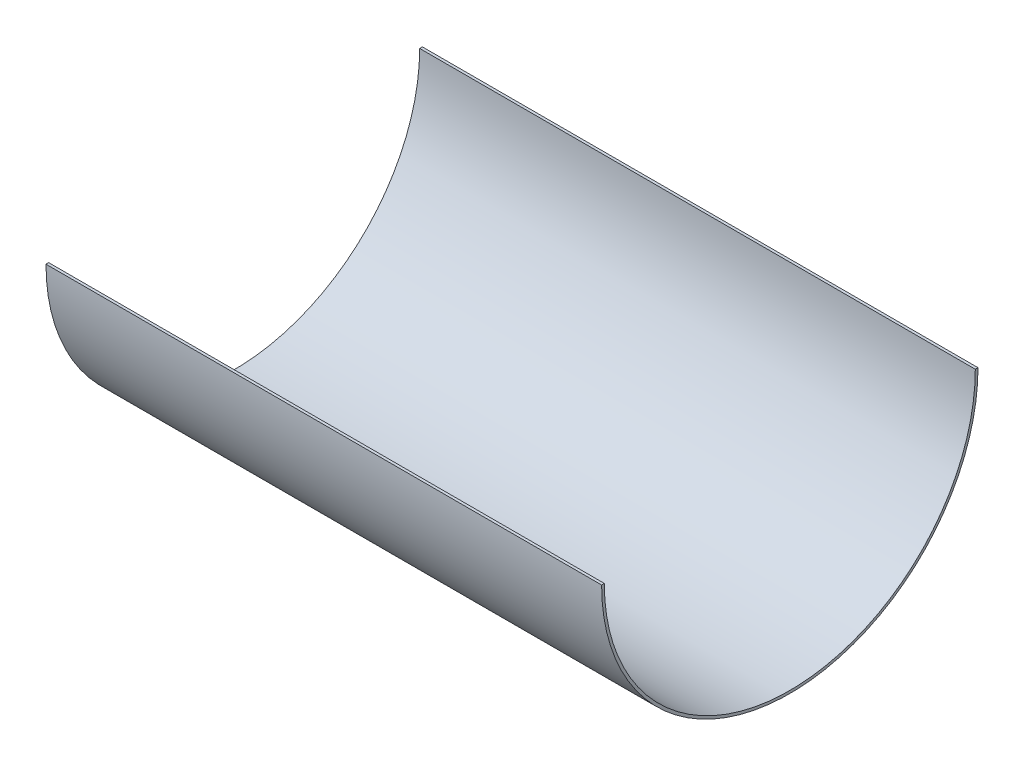
ISO-10303-21;
HEADER;
FILE_DESCRIPTION(('STEP AP214'),'2;1');
FILE_NAME('part.step','',(''),(''),'','','');
FILE_SCHEMA(('AUTOMOTIVE_DESIGN { 1 0 10303 214 1 1 1 1 }'));
ENDSEC;
DATA;
#1=APPLICATION_CONTEXT('core data for automotive mechanical design processes');
#2=APPLICATION_PROTOCOL_DEFINITION('international standard','automotive_design',2000,#1);
#3=PRODUCT_CONTEXT('',#1,'mechanical');
#4=PRODUCT('Part','Part','',(#3));
#5=PRODUCT_RELATED_PRODUCT_CATEGORY('part','',(#4));
#6=PRODUCT_DEFINITION_FORMATION('','',#4);
#7=PRODUCT_DEFINITION_CONTEXT('part definition',#1,'design');
#8=PRODUCT_DEFINITION('design','',#6,#7);
#9=PRODUCT_DEFINITION_SHAPE('','',#8);
#10=(LENGTH_UNIT() NAMED_UNIT(*) SI_UNIT(.MILLI.,.METRE.));
#11=(NAMED_UNIT(*) PLANE_ANGLE_UNIT() SI_UNIT($,.RADIAN.));
#12=(NAMED_UNIT(*) SI_UNIT($,.STERADIAN.) SOLID_ANGLE_UNIT());
#13=UNCERTAINTY_MEASURE_WITH_UNIT(LENGTH_MEASURE(1.E-05),#10,'distance_accuracy_value','');
#14=(GEOMETRIC_REPRESENTATION_CONTEXT(3) GLOBAL_UNCERTAINTY_ASSIGNED_CONTEXT((#13)) GLOBAL_UNIT_ASSIGNED_CONTEXT((#10,
#11,#12)) REPRESENTATION_CONTEXT('',''));
#15=CARTESIAN_POINT('',(0.,0.,0.));
#16=DIRECTION('',(0.,0.,1.));
#17=DIRECTION('',(1.,0.,0.));
#18=AXIS2_PLACEMENT_3D('',#15,#16,#17);
#19=CARTESIAN_POINT('',(-396.592099755992,0.,312.435963201851));
#20=DIRECTION('',(-1.,0.,0.));
#21=DIRECTION('',(0.,0.,1.));
#22=AXIS2_PLACEMENT_3D('',#19,#20,#21);
#23=CYLINDRICAL_SURFACE('',#22,210.);
#24=DIRECTION('',(-1.,0.,0.));
#25=VECTOR('',#24,1.);
#26=CARTESIAN_POINT('',(-396.592099755992,0.,102.435963201851));
#27=LINE('',#26,#25);
#28=CARTESIAN_POINT('',(581.58387703481,0.,102.435963201851));
#29=VERTEX_POINT('',#28);
#30=CARTESIAN_POINT('',(-38.4161229651902,0.,102.435963201851));
#31=VERTEX_POINT('',#30);
#32=EDGE_CURVE('E99',#29,#31,#27,.T.);
#33=ORIENTED_EDGE('',*,*,#32,.F.);
#34=CARTESIAN_POINT('',(581.58387703481,0.,312.435963201851));
#35=DIRECTION('',(-1.,0.,0.));
#36=DIRECTION('',(0.,0.,1.));
#37=AXIS2_PLACEMENT_3D('',#34,#35,#36);
#38=CIRCLE('',#37,210.);
#39=CARTESIAN_POINT('',(581.58387703481,0.,522.435963201851));
#40=VERTEX_POINT('',#39);
#41=EDGE_CURVE('E42',#29,#40,#38,.T.);
#42=ORIENTED_EDGE('',*,*,#41,.T.);
#43=DIRECTION('',(-1.,0.,0.));
#44=VECTOR('',#43,1.);
#45=CARTESIAN_POINT('',(-396.592099755992,0.,522.435963201851));
#46=LINE('',#45,#44);
#47=CARTESIAN_POINT('',(-38.4161229651903,0.,522.435963201851));
#48=VERTEX_POINT('',#47);
#49=EDGE_CURVE('E94',#48,#40,#46,.F.);
#50=ORIENTED_EDGE('',*,*,#49,.F.);
#51=CARTESIAN_POINT('',(-38.4161229651903,0.,312.435963201851));
#52=DIRECTION('',(-1.,0.,0.));
#53=DIRECTION('',(0.,0.,1.));
#54=AXIS2_PLACEMENT_3D('',#51,#52,#53);
#55=CIRCLE('',#54,210.);
#56=EDGE_CURVE('E11',#31,#48,#55,.T.);
#57=ORIENTED_EDGE('',*,*,#56,.F.);
#58=EDGE_LOOP('',(#33,#42,#50,#57));
#59=FACE_BOUND('',#58,.T.);
#60=ADVANCED_FACE('F35',(#59),#23,.T.);
#61=CARTESIAN_POINT('',(581.572240946435,0.,105.435963201855));
#62=CARTESIAN_POINT('',(582.424150652376,0.,105.442600659164));
#63=CARTESIAN_POINT('',(584.137918536488,0.,105.468851394561));
#64=CARTESIAN_POINT('',(587.484086921425,0.,105.571526795944));
#65=CARTESIAN_POINT('',(591.571096113027,0.,105.792916991487));
#66=CARTESIAN_POINT('',(596.307608868529,0.,106.202626940194));
#67=CARTESIAN_POINT('',(602.409126826052,0.,106.934758125947));
#68=CARTESIAN_POINT('',(609.639419086535,0.,108.18665602962));
#69=CARTESIAN_POINT('',(617.70585707123,0.,110.190510235831));
#70=CARTESIAN_POINT('',(625.186745255784,0.,112.659295821792));
#71=CARTESIAN_POINT('',(634.414245375346,0.,116.523312816482));
#72=CARTESIAN_POINT('',(644.61207372756,0.,122.339029978004));
#73=CARTESIAN_POINT('',(654.913796391652,0.,130.630357057189));
#74=CARTESIAN_POINT('',(663.46928585493,0.,139.982021209339));
#75=CARTESIAN_POINT('',(670.45039121658,0.,150.141502012286));
#76=CARTESIAN_POINT('',(676.016737994154,0.,160.847618744532));
#77=CARTESIAN_POINT('',(680.323342135693,0.,171.82903786729));
#78=CARTESIAN_POINT('',(683.525745860682,0.,182.806951111899));
#79=CARTESIAN_POINT('',(685.782094183419,0.,193.498408860527));
#80=CARTESIAN_POINT('',(687.253383878059,0.,203.618874423817));
#81=CARTESIAN_POINT('',(687.961369137142,0.,211.33978533163));
#82=CARTESIAN_POINT('',(688.299442483134,0.,216.947462036163));
#83=CARTESIAN_POINT('',(688.459593049096,0.,220.834002423392));
#84=CARTESIAN_POINT('',(688.547117141363,0.,224.365875374698));
#85=CARTESIAN_POINT('',(688.582824388612,0.,227.512914090602));
#86=CARTESIAN_POINT('',(688.586742369723,0.,229.777140480908));
#87=CARTESIAN_POINT('',(688.584795316882,0.,231.383827188645));
#88=CARTESIAN_POINT('',(688.583877034809,0.,232.075985648928));
#89=CARTESIAN_POINT('',(688.583877034809,0.,232.435963191891));
#90=B_SPLINE_CURVE_WITH_KNOTS('',3,(#61,#62,#63,#64,#65,#66,#67,#68,#69,#70,#71,#72,#73,#74,#75,
#76,#77,#78,#79,#80,#81,#82,#83,#84,#85,#86,#87,#88,#89),.UNSPECIFIED.,.F.,.F.,(4,1,1,1,1,1,1,1,
1,1,1,1,1,1,1,1,1,1,1,1,1,1,1,1,1,1,4),(3.49728876252685E-05,0.0078471996619407,
0.0156594264362561,0.031283879984887,0.0469083335335178,0.0625327870821487,0.0937816941794104,
0.125030601276672,0.156279508373934,0.187528415471196,0.250026229665719,0.312524043860242,
0.375021858054766,0.437519672249289,0.500017486443813,0.562515300638336,0.625013114832859,
0.687510929027383,0.750008743221906,0.81250655741643,0.843755464513691,0.875004371610953,
0.906253278708215,0.937502185805477,0.968751092902738,0.984375546451369,1.),.UNSPECIFIED.);
#91=CARTESIAN_POINT('',(-396.592099755992,0.,312.435963201851));
#92=DIRECTION('',(-1.,0.,0.));
#93=AXIS1_PLACEMENT('',#91,#92);
#94=SURFACE_OF_REVOLUTION('',#90,#93);
#95=CARTESIAN_POINT('',(581.572240946435,0.,519.435963201847));
#96=CARTESIAN_POINT('',(582.424150652376,0.,519.429325744537));
#97=CARTESIAN_POINT('',(584.137918536488,0.,519.40307500914));
#98=CARTESIAN_POINT('',(587.484086921425,0.,519.300399607757));
#99=CARTESIAN_POINT('',(591.571096113027,0.,519.079009412215));
#100=CARTESIAN_POINT('',(596.307608868529,0.,518.669299463507));
#101=CARTESIAN_POINT('',(602.409126826052,0.,517.937168277754));
#102=CARTESIAN_POINT('',(609.639419086535,0.,516.685270374081));
#103=CARTESIAN_POINT('',(617.70585707123,0.,514.68141616787));
#104=CARTESIAN_POINT('',(625.186745255784,0.,512.212630581909));
#105=CARTESIAN_POINT('',(634.414245375346,0.,508.34861358722));
#106=CARTESIAN_POINT('',(644.61207372756,0.,502.532896425697));
#107=CARTESIAN_POINT('',(654.913796391652,0.,494.241569346513));
#108=CARTESIAN_POINT('',(663.46928585493,0.,484.889905194362));
#109=CARTESIAN_POINT('',(670.45039121658,0.,474.730424391415));
#110=CARTESIAN_POINT('',(676.016737994154,0.,464.024307659169));
#111=CARTESIAN_POINT('',(680.323342135693,0.,453.042888536411));
#112=CARTESIAN_POINT('',(683.525745860682,0.,442.064975291802));
#113=CARTESIAN_POINT('',(685.782094183419,0.,431.373517543175));
#114=CARTESIAN_POINT('',(687.253383878059,0.,421.253051979885));
#115=CARTESIAN_POINT('',(687.961369137142,0.,413.532141072071));
#116=CARTESIAN_POINT('',(688.299442483134,0.,407.924464367538));
#117=CARTESIAN_POINT('',(688.459593049096,0.,404.03792398031));
#118=CARTESIAN_POINT('',(688.547117141363,0.,400.506051029004));
#119=CARTESIAN_POINT('',(688.582824388612,0.,397.359012313099));
#120=CARTESIAN_POINT('',(688.586742369723,0.,395.094785922793));
#121=CARTESIAN_POINT('',(688.584795316882,0.,393.488099215056));
#122=CARTESIAN_POINT('',(688.583877034809,0.,392.795940754773));
#123=CARTESIAN_POINT('',(688.583877034809,0.,392.43596321181));
#124=B_SPLINE_CURVE_WITH_KNOTS('',3,(#95,#96,#97,#98,#99,#100,#101,#102,#103,#104,#105,#106,
#107,#108,#109,#110,#111,#112,#113,#114,#115,#116,#117,#118,#119,#120,#121,#122,#123),
.UNSPECIFIED.,.F.,.F.,(4,1,1,1,1,1,1,1,1,1,1,1,1,1,1,1,1,1,1,1,1,1,1,1,1,1,4),
(3.49728876252685E-05,0.0078471996619407,0.0156594264362561,0.031283879984887,
0.0469083335335178,0.0625327870821487,0.0937816941794104,0.125030601276672,0.156279508373934,
0.187528415471196,0.250026229665719,0.312524043860242,0.375021858054766,0.437519672249289,
0.500017486443813,0.562515300638336,0.625013114832859,0.687510929027383,0.750008743221906,
0.81250655741643,0.843755464513691,0.875004371610953,0.906253278708215,0.937502185805477,
0.968751092902738,0.984375546451369,1.),.UNSPECIFIED.);
#125=CARTESIAN_POINT('',(581.58387703481,0.,519.435872140929));
#126=VERTEX_POINT('',#125);
#127=CARTESIAN_POINT('',(581.572240946435,0.,519.435959901095));
#128=VERTEX_POINT('',#127);
#129=EDGE_CURVE('E57',#126,#128,#124,.F.);
#130=ORIENTED_EDGE('',*,*,#129,.F.);
#131=CARTESIAN_POINT('',(581.58387703481,0.,312.435963201851));
#132=DIRECTION('',(-1.,0.,0.));
#133=DIRECTION('',(0.,0.,1.));
#134=AXIS2_PLACEMENT_3D('',#131,#132,#133);
#135=CIRCLE('',#134,206.999908939078);
#136=CARTESIAN_POINT('',(581.58387703481,0.,105.436054262773));
#137=VERTEX_POINT('',#136);
#138=EDGE_CURVE('E88',#126,#137,#135,.F.);
#139=ORIENTED_EDGE('',*,*,#138,.T.);
#140=CARTESIAN_POINT('',(581.572240946435,0.,105.435963201855));
#141=CARTESIAN_POINT('',(582.424150652376,0.,105.442600659164));
#142=CARTESIAN_POINT('',(584.137918536488,0.,105.468851394561));
#143=CARTESIAN_POINT('',(587.484086921425,0.,105.571526795944));
#144=CARTESIAN_POINT('',(591.571096113027,0.,105.792916991487));
#145=CARTESIAN_POINT('',(596.307608868529,0.,106.202626940194));
#146=CARTESIAN_POINT('',(602.409126826052,0.,106.934758125947));
#147=CARTESIAN_POINT('',(609.639419086535,0.,108.18665602962));
#148=CARTESIAN_POINT('',(617.70585707123,0.,110.190510235831));
#149=CARTESIAN_POINT('',(625.186745255784,0.,112.659295821792));
#150=CARTESIAN_POINT('',(634.414245375346,0.,116.523312816482));
#151=CARTESIAN_POINT('',(644.61207372756,0.,122.339029978004));
#152=CARTESIAN_POINT('',(654.913796391652,0.,130.630357057189));
#153=CARTESIAN_POINT('',(663.46928585493,0.,139.982021209339));
#154=CARTESIAN_POINT('',(670.45039121658,0.,150.141502012286));
#155=CARTESIAN_POINT('',(676.016737994154,0.,160.847618744532));
#156=CARTESIAN_POINT('',(680.323342135693,0.,171.82903786729));
#157=CARTESIAN_POINT('',(683.525745860682,0.,182.806951111899));
#158=CARTESIAN_POINT('',(685.782094183419,0.,193.498408860527));
#159=CARTESIAN_POINT('',(687.253383878059,0.,203.618874423817));
#160=CARTESIAN_POINT('',(687.961369137142,0.,211.33978533163));
#161=CARTESIAN_POINT('',(688.299442483134,0.,216.947462036163));
#162=CARTESIAN_POINT('',(688.459593049096,0.,220.834002423392));
#163=CARTESIAN_POINT('',(688.547117141363,0.,224.365875374698));
#164=CARTESIAN_POINT('',(688.582824388612,0.,227.512914090602));
#165=CARTESIAN_POINT('',(688.586742369723,0.,229.777140480908));
#166=CARTESIAN_POINT('',(688.584795316882,0.,231.383827188645));
#167=CARTESIAN_POINT('',(688.583877034809,0.,232.075985648928));
#168=CARTESIAN_POINT('',(688.583877034809,0.,232.435963191891));
#169=B_SPLINE_CURVE_WITH_KNOTS('',3,(#140,#141,#142,#143,#144,#145,#146,#147,#148,#149,#150,
#151,#152,#153,#154,#155,#156,#157,#158,#159,#160,#161,#162,#163,#164,#165,#166,#167,#168),
.UNSPECIFIED.,.F.,.F.,(4,1,1,1,1,1,1,1,1,1,1,1,1,1,1,1,1,1,1,1,1,1,1,1,1,1,4),
(3.49728876252685E-05,0.0078471996619407,0.0156594264362561,0.031283879984887,
0.0469083335335178,0.0625327870821487,0.0937816941794104,0.125030601276672,0.156279508373934,
0.187528415471196,0.250026229665719,0.312524043860242,0.375021858054766,0.437519672249289,
0.500017486443813,0.562515300638336,0.625013114832859,0.687510929027383,0.750008743221906,
0.81250655741643,0.843755464513691,0.875004371610953,0.906253278708215,0.937502185805477,
0.968751092902738,0.984375546451369,1.),.UNSPECIFIED.);
#170=CARTESIAN_POINT('',(581.572240946435,0.,105.435966502606));
#171=VERTEX_POINT('',#170);
#172=EDGE_CURVE('E100',#171,#137,#169,.T.);
#173=ORIENTED_EDGE('',*,*,#172,.F.);
#174=CARTESIAN_POINT('',(581.572240946435,0.,312.435963201851));
#175=DIRECTION('',(-1.,0.,0.));
#176=DIRECTION('',(0.,0.,1.));
#177=AXIS2_PLACEMENT_3D('',#174,#175,#176);
#178=CIRCLE('',#177,206.999999999996);
#179=EDGE_CURVE('E104',#171,#128,#178,.T.);
#180=ORIENTED_EDGE('',*,*,#179,.T.);
#181=EDGE_LOOP('',(#130,#139,#173,#180));
#182=FACE_BOUND('',#181,.T.);
#183=ADVANCED_FACE('F118',(#182),#94,.T.);
#184=CARTESIAN_POINT('',(-396.592099755992,0.,312.435963201851));
#185=DIRECTION('',(-1.,0.,0.));
#186=DIRECTION('',(0.,0.,1.));
#187=AXIS2_PLACEMENT_3D('',#184,#185,#186);
#188=CYLINDRICAL_SURFACE('',#187,206.999996699244);
#189=DIRECTION('',(-1.,0.,0.));
#190=VECTOR('',#189,1.);
#191=CARTESIAN_POINT('',(-396.592099755992,0.,105.435966502606));
#192=LINE('',#191,#190);
#193=CARTESIAN_POINT('',(-38.416122951138,0.,105.435969803358));
#194=VERTEX_POINT('',#193);
#195=EDGE_CURVE('E49',#194,#171,#192,.F.);
#196=ORIENTED_EDGE('',*,*,#195,.F.);
#197=CARTESIAN_POINT('',(-38.416122951138,0.,312.435963201851));
#198=DIRECTION('',(-1.,0.,0.));
#199=DIRECTION('',(0.,0.,1.));
#200=AXIS2_PLACEMENT_3D('',#197,#198,#199);
#201=CIRCLE('',#200,206.999993398492);
#202=CARTESIAN_POINT('',(-38.4161229651903,0.,519.435958250719));
#203=VERTEX_POINT('',#202);
#204=EDGE_CURVE('E106',#194,#203,#201,.T.);
#205=ORIENTED_EDGE('',*,*,#204,.T.);
#206=DIRECTION('',(-1.,0.,0.));
#207=VECTOR('',#206,1.);
#208=CARTESIAN_POINT('',(-396.592099755992,0.,519.435959901095));
#209=LINE('',#208,#207);
#210=EDGE_CURVE('E89',#128,#203,#209,.T.);
#211=ORIENTED_EDGE('',*,*,#210,.F.);
#212=ORIENTED_EDGE('',*,*,#179,.F.);
#213=EDGE_LOOP('',(#196,#205,#211,#212));
#214=FACE_BOUND('',#213,.T.);
#215=ADVANCED_FACE('F121',(#214),#188,.F.);
#216=CARTESIAN_POINT('',(1604.84151052828,0.,737.495931307423));
#217=DIRECTION('',(0.,1.,0.));
#218=DIRECTION('',(-1.,0.,0.));
#219=AXIS2_PLACEMENT_3D('',#216,#217,#218);
#220=PLANE('',#219);
#221=ORIENTED_EDGE('',*,*,#32,.T.);
#222=DIRECTION('',(0.,0.,-1.));
#223=VECTOR('',#222,1.);
#224=CARTESIAN_POINT('',(-38.4161229651903,0.,737.495931307423));
#225=LINE('',#224,#223);
#226=EDGE_CURVE('E178',#194,#31,#225,.T.);
#227=ORIENTED_EDGE('',*,*,#226,.F.);
#228=ORIENTED_EDGE('',*,*,#195,.T.);
#229=ORIENTED_EDGE('',*,*,#172,.T.);
#230=DIRECTION('',(0.,0.,-1.));
#231=VECTOR('',#230,1.);
#232=CARTESIAN_POINT('',(581.58387703481,0.,737.495931307423));
#233=LINE('',#232,#231);
#234=EDGE_CURVE('E90',#137,#29,#233,.T.);
#235=ORIENTED_EDGE('',*,*,#234,.T.);
#236=EDGE_LOOP('',(#221,#227,#228,#229,#235));
#237=FACE_BOUND('',#236,.T.);
#238=ADVANCED_FACE('F125',(#237),#220,.T.);
#239=ORIENTED_EDGE('',*,*,#49,.T.);
#240=EDGE_CURVE('E82',#40,#126,#233,.T.);
#241=ORIENTED_EDGE('',*,*,#240,.T.);
#242=ORIENTED_EDGE('',*,*,#129,.T.);
#243=ORIENTED_EDGE('',*,*,#210,.T.);
#244=EDGE_CURVE('E96',#48,#203,#225,.T.);
#245=ORIENTED_EDGE('',*,*,#244,.F.);
#246=EDGE_LOOP('',(#239,#241,#242,#243,#245));
#247=FACE_BOUND('',#246,.T.);
#248=ADVANCED_FACE('F95',(#247),#220,.T.);
#249=CARTESIAN_POINT('',(-38.4161229651903,-500.,-104.316345756687));
#250=DIRECTION('',(1.,0.,0.));
#251=DIRECTION('',(0.,0.,-1.));
#252=AXIS2_PLACEMENT_3D('',#249,#250,#251);
#253=PLANE('',#252);
#254=ORIENTED_EDGE('',*,*,#226,.T.);
#255=ORIENTED_EDGE('',*,*,#56,.T.);
#256=ORIENTED_EDGE('',*,*,#244,.T.);
#257=ORIENTED_EDGE('',*,*,#204,.F.);
#258=EDGE_LOOP('',(#254,#255,#256,#257));
#259=FACE_BOUND('',#258,.T.);
#260=ADVANCED_FACE('F129',(#259),#253,.F.);
#261=CARTESIAN_POINT('',(581.58387703481,-500.,736.451025032999));
#262=DIRECTION('',(-1.,0.,0.));
#263=DIRECTION('',(0.,0.,1.));
#264=AXIS2_PLACEMENT_3D('',#261,#262,#263);
#265=PLANE('',#264);
#266=ORIENTED_EDGE('',*,*,#234,.F.);
#267=ORIENTED_EDGE('',*,*,#138,.F.);
#268=ORIENTED_EDGE('',*,*,#240,.F.);
#269=ORIENTED_EDGE('',*,*,#41,.F.);
#270=EDGE_LOOP('',(#266,#267,#268,#269));
#271=FACE_BOUND('',#270,.T.);
#272=ADVANCED_FACE('F84',(#271),#265,.F.);
#273=CLOSED_SHELL('',(#60,#183,#215,#238,#248,#260,#272));
#274=MANIFOLD_SOLID_BREP('B2',#273);
#275=ADVANCED_BREP_SHAPE_REPRESENTATION('',(#18,#274),#14);
#276=SHAPE_DEFINITION_REPRESENTATION(#9,#275);
ENDSEC;
END-ISO-10303-21;
